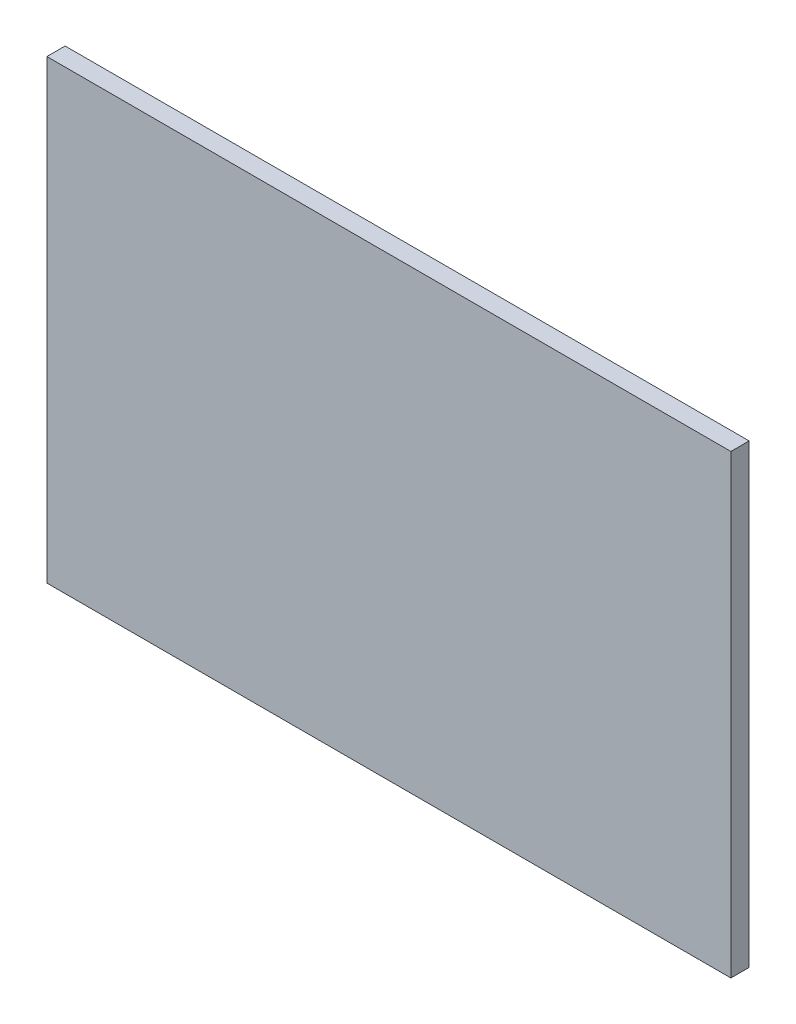
ISO-10303-21;
HEADER;
FILE_DESCRIPTION(('STEP AP214'),'2;1');
FILE_NAME('part.step','',(''),(''),'','','');
FILE_SCHEMA(('AUTOMOTIVE_DESIGN { 1 0 10303 214 1 1 1 1 }'));
ENDSEC;
DATA;
#1=APPLICATION_CONTEXT('core data for automotive mechanical design processes');
#2=APPLICATION_PROTOCOL_DEFINITION('international standard','automotive_design',2000,#1);
#3=PRODUCT_CONTEXT('',#1,'mechanical');
#4=PRODUCT('Part','Part','',(#3));
#5=PRODUCT_RELATED_PRODUCT_CATEGORY('part','',(#4));
#6=PRODUCT_DEFINITION_FORMATION('','',#4);
#7=PRODUCT_DEFINITION_CONTEXT('part definition',#1,'design');
#8=PRODUCT_DEFINITION('design','',#6,#7);
#9=PRODUCT_DEFINITION_SHAPE('','',#8);
#10=(LENGTH_UNIT() NAMED_UNIT(*) SI_UNIT(.MILLI.,.METRE.));
#11=(NAMED_UNIT(*) PLANE_ANGLE_UNIT() SI_UNIT($,.RADIAN.));
#12=(NAMED_UNIT(*) SI_UNIT($,.STERADIAN.) SOLID_ANGLE_UNIT());
#13=UNCERTAINTY_MEASURE_WITH_UNIT(LENGTH_MEASURE(1.E-05),#10,'distance_accuracy_value','');
#14=(GEOMETRIC_REPRESENTATION_CONTEXT(3) GLOBAL_UNCERTAINTY_ASSIGNED_CONTEXT((#13)) GLOBAL_UNIT_ASSIGNED_CONTEXT((#10,
#11,#12)) REPRESENTATION_CONTEXT('',''));
#15=CARTESIAN_POINT('',(0.,0.,0.));
#16=DIRECTION('',(0.,0.,1.));
#17=DIRECTION('',(1.,0.,0.));
#18=AXIS2_PLACEMENT_3D('',#15,#16,#17);
#19=CARTESIAN_POINT('',(75.0000000000001,100.,2.60208521396521E-13));
#20=DIRECTION('',(1.,0.,0.));
#21=DIRECTION('',(0.,0.,-1.));
#22=AXIS2_PLACEMENT_3D('',#19,#20,#21);
#23=PLANE('',#22);
#24=DIRECTION('',(0.,0.,1.));
#25=VECTOR('',#24,1.);
#26=CARTESIAN_POINT('',(75.0000000000001,0.,2.60208521396521E-13));
#27=LINE('',#26,#25);
#28=CARTESIAN_POINT('',(75.,0.,21.));
#29=VERTEX_POINT('',#28);
#30=CARTESIAN_POINT('',(75.,0.,25.));
#31=VERTEX_POINT('',#30);
#32=EDGE_CURVE('E97',#29,#31,#27,.T.);
#33=ORIENTED_EDGE('',*,*,#32,.F.);
#34=DIRECTION('',(0.,-1.,0.));
#35=VECTOR('',#34,1.);
#36=CARTESIAN_POINT('',(75.,100.,21.));
#37=LINE('',#36,#35);
#38=CARTESIAN_POINT('',(75.,100.,21.));
#39=VERTEX_POINT('',#38);
#40=EDGE_CURVE('E11',#39,#29,#37,.T.);
#41=ORIENTED_EDGE('',*,*,#40,.F.);
#42=DIRECTION('',(0.,0.,1.));
#43=VECTOR('',#42,1.);
#44=CARTESIAN_POINT('',(75.0000000000001,100.,2.60208521396521E-13));
#45=LINE('',#44,#43);
#46=CARTESIAN_POINT('',(75.,100.,25.));
#47=VERTEX_POINT('',#46);
#48=EDGE_CURVE('E91',#39,#47,#45,.T.);
#49=ORIENTED_EDGE('',*,*,#48,.T.);
#50=DIRECTION('',(0.,-1.,0.));
#51=VECTOR('',#50,1.);
#52=CARTESIAN_POINT('',(75.,100.,25.));
#53=LINE('',#52,#51);
#54=EDGE_CURVE('E72',#47,#31,#53,.T.);
#55=ORIENTED_EDGE('',*,*,#54,.T.);
#56=EDGE_LOOP('',(#33,#41,#49,#55));
#57=FACE_BOUND('',#56,.T.);
#58=ADVANCED_FACE('F34',(#57),#23,.T.);
#59=CARTESIAN_POINT('',(0.,100.,21.));
#60=DIRECTION('',(0.,0.,-1.));
#61=DIRECTION('',(-1.,0.,0.));
#62=AXIS2_PLACEMENT_3D('',#59,#60,#61);
#63=PLANE('',#62);
#64=DIRECTION('',(1.,0.,0.));
#65=VECTOR('',#64,1.);
#66=CARTESIAN_POINT('',(0.,0.,21.));
#67=LINE('',#66,#65);
#68=CARTESIAN_POINT('',(-75.,0.,21.));
#69=VERTEX_POINT('',#68);
#70=EDGE_CURVE('E85',#69,#29,#67,.T.);
#71=ORIENTED_EDGE('',*,*,#70,.F.);
#72=DIRECTION('',(0.,-1.,0.));
#73=VECTOR('',#72,1.);
#74=CARTESIAN_POINT('',(-75.,100.,21.));
#75=LINE('',#74,#73);
#76=CARTESIAN_POINT('',(-75.,100.,21.));
#77=VERTEX_POINT('',#76);
#78=EDGE_CURVE('E42',#77,#69,#75,.T.);
#79=ORIENTED_EDGE('',*,*,#78,.F.);
#80=DIRECTION('',(1.,0.,0.));
#81=VECTOR('',#80,1.);
#82=CARTESIAN_POINT('',(0.,100.,21.));
#83=LINE('',#82,#81);
#84=EDGE_CURVE('E83',#77,#39,#83,.T.);
#85=ORIENTED_EDGE('',*,*,#84,.T.);
#86=ORIENTED_EDGE('',*,*,#40,.T.);
#87=EDGE_LOOP('',(#71,#79,#85,#86));
#88=FACE_BOUND('',#87,.T.);
#89=ADVANCED_FACE('F81',(#88),#63,.T.);
#90=CARTESIAN_POINT('',(-75.0000000000001,100.,2.60208521396521E-13));
#91=DIRECTION('',(1.,0.,0.));
#92=DIRECTION('',(0.,0.,-1.));
#93=AXIS2_PLACEMENT_3D('',#90,#91,#92);
#94=PLANE('',#93);
#95=DIRECTION('',(0.,0.,1.));
#96=VECTOR('',#95,1.);
#97=CARTESIAN_POINT('',(-75.0000000000001,0.,2.60208521396521E-13));
#98=LINE('',#97,#96);
#99=CARTESIAN_POINT('',(-75.,0.,25.));
#100=VERTEX_POINT('',#99);
#101=EDGE_CURVE('E65',#69,#100,#98,.T.);
#102=ORIENTED_EDGE('',*,*,#101,.T.);
#103=DIRECTION('',(0.,-1.,0.));
#104=VECTOR('',#103,1.);
#105=CARTESIAN_POINT('',(-75.,100.,25.));
#106=LINE('',#105,#104);
#107=CARTESIAN_POINT('',(-75.,100.,25.));
#108=VERTEX_POINT('',#107);
#109=EDGE_CURVE('E86',#108,#100,#106,.T.);
#110=ORIENTED_EDGE('',*,*,#109,.F.);
#111=DIRECTION('',(0.,0.,1.));
#112=VECTOR('',#111,1.);
#113=CARTESIAN_POINT('',(-75.0000000000001,100.,2.60208521396521E-13));
#114=LINE('',#113,#112);
#115=EDGE_CURVE('E87',#77,#108,#114,.T.);
#116=ORIENTED_EDGE('',*,*,#115,.F.);
#117=ORIENTED_EDGE('',*,*,#78,.T.);
#118=EDGE_LOOP('',(#102,#110,#116,#117));
#119=FACE_BOUND('',#118,.T.);
#120=ADVANCED_FACE('F88',(#119),#94,.F.);
#121=CARTESIAN_POINT('',(0.,100.,25.));
#122=DIRECTION('',(0.,0.,-1.));
#123=DIRECTION('',(-1.,0.,0.));
#124=AXIS2_PLACEMENT_3D('',#121,#122,#123);
#125=PLANE('',#124);
#126=DIRECTION('',(1.,0.,0.));
#127=VECTOR('',#126,1.);
#128=CARTESIAN_POINT('',(0.,0.,25.));
#129=LINE('',#128,#127);
#130=EDGE_CURVE('E93',#100,#31,#129,.T.);
#131=ORIENTED_EDGE('',*,*,#130,.T.);
#132=ORIENTED_EDGE('',*,*,#54,.F.);
#133=DIRECTION('',(1.,0.,0.));
#134=VECTOR('',#133,1.);
#135=CARTESIAN_POINT('',(0.,100.,25.));
#136=LINE('',#135,#134);
#137=EDGE_CURVE('E50',#108,#47,#136,.T.);
#138=ORIENTED_EDGE('',*,*,#137,.F.);
#139=ORIENTED_EDGE('',*,*,#109,.T.);
#140=EDGE_LOOP('',(#131,#132,#138,#139));
#141=FACE_BOUND('',#140,.T.);
#142=ADVANCED_FACE('F106',(#141),#125,.F.);
#143=CARTESIAN_POINT('',(0.,100.,0.));
#144=DIRECTION('',(0.,1.,0.));
#145=DIRECTION('',(0.,0.,1.));
#146=AXIS2_PLACEMENT_3D('',#143,#144,#145);
#147=PLANE('',#146);
#148=ORIENTED_EDGE('',*,*,#48,.F.);
#149=ORIENTED_EDGE('',*,*,#84,.F.);
#150=ORIENTED_EDGE('',*,*,#115,.T.);
#151=ORIENTED_EDGE('',*,*,#137,.T.);
#152=EDGE_LOOP('',(#148,#149,#150,#151));
#153=FACE_BOUND('',#152,.T.);
#154=ADVANCED_FACE('F90',(#153),#147,.T.);
#155=CARTESIAN_POINT('',(0.,0.,0.));
#156=DIRECTION('',(0.,1.,0.));
#157=DIRECTION('',(0.,0.,1.));
#158=AXIS2_PLACEMENT_3D('',#155,#156,#157);
#159=PLANE('',#158);
#160=ORIENTED_EDGE('',*,*,#32,.T.);
#161=ORIENTED_EDGE('',*,*,#130,.F.);
#162=ORIENTED_EDGE('',*,*,#101,.F.);
#163=ORIENTED_EDGE('',*,*,#70,.T.);
#164=EDGE_LOOP('',(#160,#161,#162,#163));
#165=FACE_BOUND('',#164,.T.);
#166=ADVANCED_FACE('F108',(#165),#159,.F.);
#167=CLOSED_SHELL('',(#58,#89,#120,#142,#154,#166));
#168=MANIFOLD_SOLID_BREP('B2',#167);
#169=ADVANCED_BREP_SHAPE_REPRESENTATION('',(#18,#168),#14);
#170=SHAPE_DEFINITION_REPRESENTATION(#9,#169);
ENDSEC;
END-ISO-10303-21;
